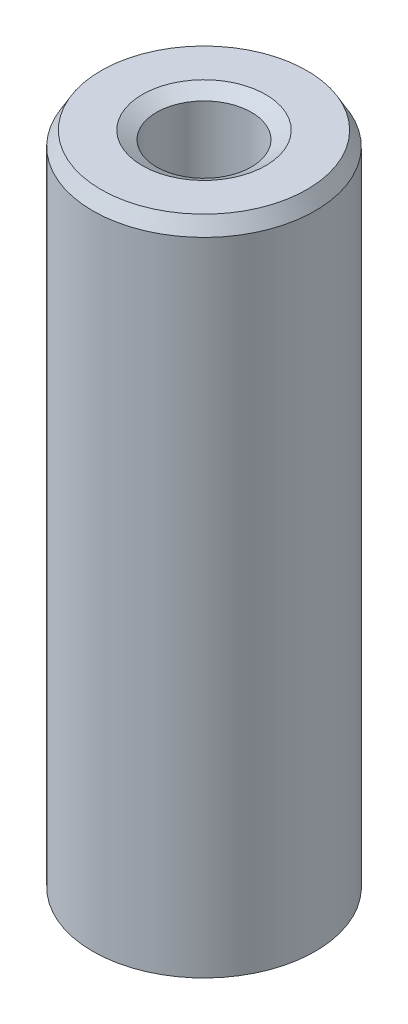
ISO-10303-21;
HEADER;
FILE_DESCRIPTION(('STEP AP214'),'2;1');
FILE_NAME('part.step','',(''),(''),'','','');
FILE_SCHEMA(('AUTOMOTIVE_DESIGN { 1 0 10303 214 1 1 1 1 }'));
ENDSEC;
DATA;
#1=APPLICATION_CONTEXT('core data for automotive mechanical design processes');
#2=APPLICATION_PROTOCOL_DEFINITION('international standard','automotive_design',2000,#1);
#3=PRODUCT_CONTEXT('',#1,'mechanical');
#4=PRODUCT('Part','Part','',(#3));
#5=PRODUCT_RELATED_PRODUCT_CATEGORY('part','',(#4));
#6=PRODUCT_DEFINITION_FORMATION('','',#4);
#7=PRODUCT_DEFINITION_CONTEXT('part definition',#1,'design');
#8=PRODUCT_DEFINITION('design','',#6,#7);
#9=PRODUCT_DEFINITION_SHAPE('','',#8);
#10=(LENGTH_UNIT() NAMED_UNIT(*) SI_UNIT(.MILLI.,.METRE.));
#11=(NAMED_UNIT(*) PLANE_ANGLE_UNIT() SI_UNIT($,.RADIAN.));
#12=(NAMED_UNIT(*) SI_UNIT($,.STERADIAN.) SOLID_ANGLE_UNIT());
#13=UNCERTAINTY_MEASURE_WITH_UNIT(LENGTH_MEASURE(1.E-05),#10,'distance_accuracy_value','');
#14=(GEOMETRIC_REPRESENTATION_CONTEXT(3) GLOBAL_UNCERTAINTY_ASSIGNED_CONTEXT((#13)) GLOBAL_UNIT_ASSIGNED_CONTEXT((#10,
#11,#12)) REPRESENTATION_CONTEXT('',''));
#15=CARTESIAN_POINT('',(0.,0.,0.));
#16=DIRECTION('',(0.,0.,1.));
#17=DIRECTION('',(1.,0.,0.));
#18=AXIS2_PLACEMENT_3D('',#15,#16,#17);
#19=CARTESIAN_POINT('',(0.,119.353758607494,0.));
#20=DIRECTION('',(0.,-1.,0.));
#21=DIRECTION('',(0.,0.,-1.));
#22=AXIS2_PLACEMENT_3D('',#19,#20,#21);
#23=CYLINDRICAL_SURFACE('',#22,20.);
#24=CARTESIAN_POINT('',(0.,1.48362405155784,0.));
#25=DIRECTION('',(0.,1.,0.));
#26=DIRECTION('',(0.,0.,1.));
#27=AXIS2_PLACEMENT_3D('',#24,#25,#26);
#28=CIRCLE('',#27,20.);
#29=CARTESIAN_POINT('',(0.,1.48362405155784,20.));
#30=VERTEX_POINT('',#29);
#31=EDGE_CURVE('E10',#30,#30,#28,.T.);
#32=ORIENTED_EDGE('',*,*,#31,.T.);
#33=EDGE_LOOP('',(#32));
#34=FACE_BOUND('',#33,.T.);
#35=CARTESIAN_POINT('',(0.,116.784046370865,0.));
#36=DIRECTION('',(0.,1.,0.));
#37=DIRECTION('',(0.,0.,1.));
#38=AXIS2_PLACEMENT_3D('',#35,#36,#37);
#39=CIRCLE('',#38,20.);
#40=CARTESIAN_POINT('',(0.,116.784046370865,20.));
#41=VERTEX_POINT('',#40);
#42=EDGE_CURVE('E50',#41,#41,#39,.F.);
#43=ORIENTED_EDGE('',*,*,#42,.T.);
#44=EDGE_LOOP('',(#43));
#45=FACE_BOUND('',#44,.T.);
#46=ADVANCED_FACE('F39',(#34,#45),#23,.T.);
#47=CARTESIAN_POINT('',(0.,119.353758607494,0.));
#48=DIRECTION('',(0.,1.,0.));
#49=DIRECTION('',(0.,0.,1.));
#50=AXIS2_PLACEMENT_3D('',#47,#48,#49);
#51=PLANE('',#50);
#52=CARTESIAN_POINT('',(0.,119.353758607494,0.));
#53=DIRECTION('',(0.,1.,0.));
#54=DIRECTION('',(0.,0.,1.));
#55=AXIS2_PLACEMENT_3D('',#52,#53,#54);
#56=CIRCLE('',#55,11.0911302467085);
#57=CARTESIAN_POINT('',(0.,119.353758607494,11.0911302467085));
#58=VERTEX_POINT('',#57);
#59=EDGE_CURVE('E58',#58,#58,#56,.F.);
#60=ORIENTED_EDGE('',*,*,#59,.T.);
#61=EDGE_LOOP('',(#60));
#62=FACE_BOUND('',#61,.T.);
#63=CARTESIAN_POINT('',(0.,119.353758607494,0.));
#64=DIRECTION('',(0.,1.,0.));
#65=DIRECTION('',(0.,0.,1.));
#66=AXIS2_PLACEMENT_3D('',#63,#64,#65);
#67=CIRCLE('',#66,18.5163759484422);
#68=CARTESIAN_POINT('',(0.,119.353758607494,18.5163759484422));
#69=VERTEX_POINT('',#68);
#70=EDGE_CURVE('E61',#69,#69,#67,.T.);
#71=ORIENTED_EDGE('',*,*,#70,.T.);
#72=EDGE_LOOP('',(#71));
#73=FACE_BOUND('',#72,.T.);
#74=ADVANCED_FACE('F88',(#62,#73),#51,.T.);
#75=CARTESIAN_POINT('',(0.,0.,0.));
#76=DIRECTION('',(0.,1.,0.));
#77=DIRECTION('',(0.,0.,1.));
#78=AXIS2_PLACEMENT_3D('',#75,#76,#77);
#79=PLANE('',#78);
#80=CARTESIAN_POINT('',(0.,0.,0.));
#81=DIRECTION('',(0.,1.,0.));
#82=DIRECTION('',(0.,0.,1.));
#83=AXIS2_PLACEMENT_3D('',#80,#81,#82);
#84=CIRCLE('',#83,10.005042061637);
#85=CARTESIAN_POINT('',(0.,0.,10.005042061637));
#86=VERTEX_POINT('',#85);
#87=EDGE_CURVE('E51',#86,#86,#84,.T.);
#88=ORIENTED_EDGE('',*,*,#87,.T.);
#89=EDGE_LOOP('',(#88));
#90=FACE_BOUND('',#89,.T.);
#91=CARTESIAN_POINT('',(0.,0.,0.));
#92=DIRECTION('',(0.,1.,0.));
#93=DIRECTION('',(0.,0.,1.));
#94=AXIS2_PLACEMENT_3D('',#91,#92,#93);
#95=CIRCLE('',#94,17.4302877633706);
#96=CARTESIAN_POINT('',(0.,0.,17.4302877633706));
#97=VERTEX_POINT('',#96);
#98=EDGE_CURVE('E54',#97,#97,#95,.F.);
#99=ORIENTED_EDGE('',*,*,#98,.T.);
#100=EDGE_LOOP('',(#99));
#101=FACE_BOUND('',#100,.T.);
#102=ADVANCED_FACE('F83',(#90,#101),#79,.F.);
#103=CARTESIAN_POINT('',(0.,119.353758607494,0.));
#104=DIRECTION('',(0.,-1.,0.));
#105=DIRECTION('',(0.,0.,-1.));
#106=AXIS2_PLACEMENT_3D('',#103,#104,#105);
#107=CYLINDRICAL_SURFACE('',#106,8.52141801007918);
#108=CARTESIAN_POINT('',(0.,117.870134555937,0.));
#109=DIRECTION('',(0.,1.,0.));
#110=DIRECTION('',(0.,0.,1.));
#111=AXIS2_PLACEMENT_3D('',#108,#109,#110);
#112=CIRCLE('',#111,8.52141801007918);
#113=CARTESIAN_POINT('',(0.,117.870134555937,8.52141801007918));
#114=VERTEX_POINT('',#113);
#115=EDGE_CURVE('E67',#114,#114,#112,.T.);
#116=ORIENTED_EDGE('',*,*,#115,.T.);
#117=EDGE_LOOP('',(#116));
#118=FACE_BOUND('',#117,.T.);
#119=CARTESIAN_POINT('',(0.,2.5697122366294,0.));
#120=DIRECTION('',(0.,1.,0.));
#121=DIRECTION('',(0.,0.,1.));
#122=AXIS2_PLACEMENT_3D('',#119,#120,#121);
#123=CIRCLE('',#122,8.52141801007918);
#124=CARTESIAN_POINT('',(0.,2.5697122366294,8.52141801007918));
#125=VERTEX_POINT('',#124);
#126=EDGE_CURVE('E69',#125,#125,#123,.F.);
#127=ORIENTED_EDGE('',*,*,#126,.T.);
#128=EDGE_LOOP('',(#127));
#129=FACE_BOUND('',#128,.T.);
#130=ADVANCED_FACE('F71',(#118,#129),#107,.F.);
#131=CARTESIAN_POINT('',(0.,117.870134555937,0.));
#132=DIRECTION('',(0.,1.,0.));
#133=DIRECTION('',(0.,0.,1.));
#134=AXIS2_PLACEMENT_3D('',#131,#132,#133);
#135=CONICAL_SURFACE('',#134,8.52141801007918,1.0471975511966);
#136=ORIENTED_EDGE('',*,*,#59,.F.);
#137=EDGE_LOOP('',(#136));
#138=FACE_BOUND('',#137,.T.);
#139=ORIENTED_EDGE('',*,*,#115,.F.);
#140=EDGE_LOOP('',(#139));
#141=FACE_BOUND('',#140,.T.);
#142=ADVANCED_FACE('F77',(#138,#141),#135,.F.);
#143=CARTESIAN_POINT('',(0.,0.,0.));
#144=DIRECTION('',(0.,-1.,0.));
#145=DIRECTION('',(0.,0.,-1.));
#146=AXIS2_PLACEMENT_3D('',#143,#144,#145);
#147=CONICAL_SURFACE('',#146,10.005042061637,0.523598775598295);
#148=ORIENTED_EDGE('',*,*,#126,.F.);
#149=EDGE_LOOP('',(#148));
#150=FACE_BOUND('',#149,.T.);
#151=ORIENTED_EDGE('',*,*,#87,.F.);
#152=EDGE_LOOP('',(#151));
#153=FACE_BOUND('',#152,.T.);
#154=ADVANCED_FACE('F73',(#150,#153),#147,.F.);
#155=CARTESIAN_POINT('',(0.,1.48362405155784,0.));
#156=DIRECTION('',(0.,1.,0.));
#157=DIRECTION('',(0.,0.,1.));
#158=AXIS2_PLACEMENT_3D('',#155,#156,#157);
#159=CONICAL_SURFACE('',#158,20.,1.0471975511966);
#160=ORIENTED_EDGE('',*,*,#98,.F.);
#161=EDGE_LOOP('',(#160));
#162=FACE_BOUND('',#161,.T.);
#163=ORIENTED_EDGE('',*,*,#31,.F.);
#164=EDGE_LOOP('',(#163));
#165=FACE_BOUND('',#164,.T.);
#166=ADVANCED_FACE('F76',(#162,#165),#159,.T.);
#167=CARTESIAN_POINT('',(0.,119.353758607494,0.));
#168=DIRECTION('',(0.,-1.,0.));
#169=DIRECTION('',(0.,0.,-1.));
#170=AXIS2_PLACEMENT_3D('',#167,#168,#169);
#171=CONICAL_SURFACE('',#170,18.5163759484422,0.523598775598289);
#172=ORIENTED_EDGE('',*,*,#42,.F.);
#173=EDGE_LOOP('',(#172));
#174=FACE_BOUND('',#173,.T.);
#175=ORIENTED_EDGE('',*,*,#70,.F.);
#176=EDGE_LOOP('',(#175));
#177=FACE_BOUND('',#176,.T.);
#178=ADVANCED_FACE('F45',(#174,#177),#171,.T.);
#179=CLOSED_SHELL('',(#46,#74,#102,#130,#142,#154,#166,#178));
#180=MANIFOLD_SOLID_BREP('B2',#179);
#181=ADVANCED_BREP_SHAPE_REPRESENTATION('',(#18,#180),#14);
#182=SHAPE_DEFINITION_REPRESENTATION(#9,#181);
ENDSEC;
END-ISO-10303-21;
